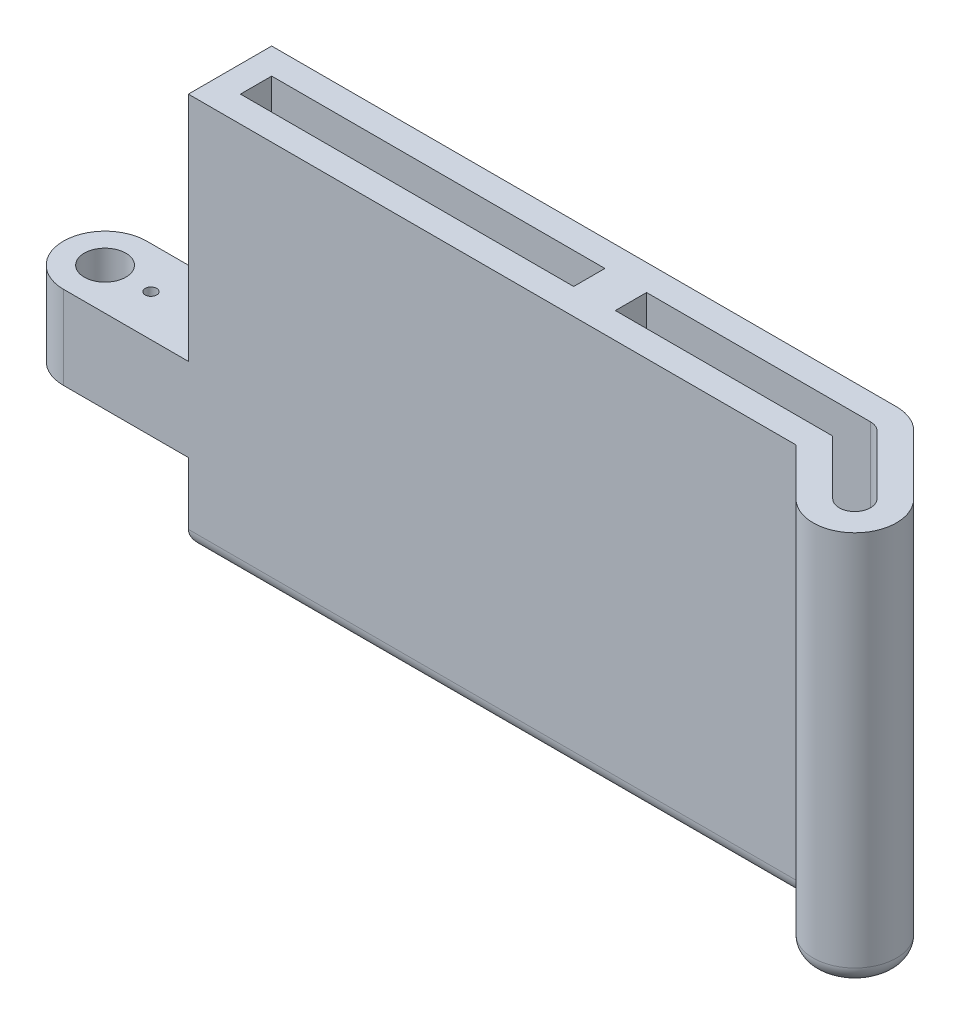
ISO-10303-21;
HEADER;
FILE_DESCRIPTION(('STEP AP214'),'2;1');
FILE_NAME('part.step','',(''),(''),'','','');
FILE_SCHEMA(('AUTOMOTIVE_DESIGN { 1 0 10303 214 1 1 1 1 }'));
ENDSEC;
DATA;
#1=APPLICATION_CONTEXT('core data for automotive mechanical design processes');
#2=APPLICATION_PROTOCOL_DEFINITION('international standard','automotive_design',2000,#1);
#3=PRODUCT_CONTEXT('',#1,'mechanical');
#4=PRODUCT('Part','Part','',(#3));
#5=PRODUCT_RELATED_PRODUCT_CATEGORY('part','',(#4));
#6=PRODUCT_DEFINITION_FORMATION('','',#4);
#7=PRODUCT_DEFINITION_CONTEXT('part definition',#1,'design');
#8=PRODUCT_DEFINITION('design','',#6,#7);
#9=PRODUCT_DEFINITION_SHAPE('','',#8);
#10=(LENGTH_UNIT() NAMED_UNIT(*) SI_UNIT(.MILLI.,.METRE.));
#11=(NAMED_UNIT(*) PLANE_ANGLE_UNIT() SI_UNIT($,.RADIAN.));
#12=(NAMED_UNIT(*) SI_UNIT($,.STERADIAN.) SOLID_ANGLE_UNIT());
#13=UNCERTAINTY_MEASURE_WITH_UNIT(LENGTH_MEASURE(1.E-05),#10,'distance_accuracy_value','');
#14=(GEOMETRIC_REPRESENTATION_CONTEXT(3) GLOBAL_UNCERTAINTY_ASSIGNED_CONTEXT((#13)) GLOBAL_UNIT_ASSIGNED_CONTEXT((#10,
#11,#12)) REPRESENTATION_CONTEXT('',''));
#15=CARTESIAN_POINT('',(0.,0.,0.));
#16=DIRECTION('',(0.,0.,1.));
#17=DIRECTION('',(1.,0.,0.));
#18=AXIS2_PLACEMENT_3D('',#15,#16,#17);
#19=CARTESIAN_POINT('',(61.6401280605348,59.999999888,-61.6401280605346));
#20=DIRECTION('',(0.707106781186549,0.,-0.707106781186546));
#21=DIRECTION('',(-0.707106781186546,0.,-0.707106781186549));
#22=AXIS2_PLACEMENT_3D('',#19,#20,#21);
#23=PLANE('',#22);
#24=DIRECTION('',(0.,-1.,0.));
#25=VECTOR('',#24,1.);
#26=CARTESIAN_POINT('',(127.770384181604,59.999999888,4.49012806053458));
#27=LINE('',#26,#25);
#28=CARTESIAN_POINT('',(127.770384181604,59.999999888,4.49012806053458));
#29=VERTEX_POINT('',#28);
#30=CARTESIAN_POINT('',(127.770384181604,2.54,4.49012806053458));
#31=VERTEX_POINT('',#30);
#32=EDGE_CURVE('E371',#29,#31,#27,.T.);
#33=ORIENTED_EDGE('',*,*,#32,.T.);
#34=DIRECTION('',(0.707106781186546,0.,0.707106781186549));
#35=VECTOR('',#34,1.);
#36=CARTESIAN_POINT('',(118.790128060535,2.54,-4.49012806053457));
#37=LINE('',#36,#35);
#38=CARTESIAN_POINT('',(118.790128060535,2.54,-4.49012806053457));
#39=VERTEX_POINT('',#38);
#40=EDGE_CURVE('E419',#31,#39,#37,.F.);
#41=ORIENTED_EDGE('',*,*,#40,.T.);
#42=DIRECTION('',(0.,-1.,0.));
#43=VECTOR('',#42,1.);
#44=CARTESIAN_POINT('',(118.790128060535,59.999999888,-4.49012806053457));
#45=LINE('',#44,#43);
#46=CARTESIAN_POINT('',(118.790128060535,59.999999888,-4.49012806053457));
#47=VERTEX_POINT('',#46);
#48=EDGE_CURVE('E388',#47,#39,#45,.T.);
#49=ORIENTED_EDGE('',*,*,#48,.F.);
#50=DIRECTION('',(0.707106781186546,0.,0.707106781186549));
#51=VECTOR('',#50,1.);
#52=CARTESIAN_POINT('',(61.6401280605348,59.999999888,-61.6401280605346));
#53=LINE('',#52,#51);
#54=EDGE_CURVE('E357',#47,#29,#53,.T.);
#55=ORIENTED_EDGE('',*,*,#54,.T.);
#56=EDGE_LOOP('',(#33,#41,#49,#55));
#57=FACE_BOUND('',#56,.T.);
#58=ADVANCED_FACE('F42',(#57),#23,.T.);
#59=CARTESIAN_POINT('',(114.3,59.999999888,0.));
#60=DIRECTION('',(0.,-1.,0.));
#61=DIRECTION('',(0.,0.,-1.));
#62=AXIS2_PLACEMENT_3D('',#59,#60,#61);
#63=CYLINDRICAL_SURFACE('',#62,6.35);
#64=ORIENTED_EDGE('',*,*,#48,.T.);
#65=CARTESIAN_POINT('',(114.3,2.54,0.));
#66=DIRECTION('',(0.,1.,0.));
#67=DIRECTION('',(0.,0.,1.));
#68=AXIS2_PLACEMENT_3D('',#65,#66,#67);
#69=CIRCLE('',#68,6.35);
#70=CARTESIAN_POINT('',(114.3,2.54,-6.35));
#71=VERTEX_POINT('',#70);
#72=EDGE_CURVE('E417',#39,#71,#69,.T.);
#73=ORIENTED_EDGE('',*,*,#72,.T.);
#74=DIRECTION('',(0.,-1.,0.));
#75=VECTOR('',#74,1.);
#76=CARTESIAN_POINT('',(114.3,59.999999888,-6.35));
#77=LINE('',#76,#75);
#78=CARTESIAN_POINT('',(114.3,59.999999888,-6.35));
#79=VERTEX_POINT('',#78);
#80=EDGE_CURVE('E386',#79,#71,#77,.T.);
#81=ORIENTED_EDGE('',*,*,#80,.F.);
#82=CARTESIAN_POINT('',(114.3,59.999999888,0.));
#83=DIRECTION('',(0.,1.,0.));
#84=DIRECTION('',(0.,0.,1.));
#85=AXIS2_PLACEMENT_3D('',#82,#83,#84);
#86=CIRCLE('',#85,6.35);
#87=EDGE_CURVE('E360',#47,#79,#86,.T.);
#88=ORIENTED_EDGE('',*,*,#87,.F.);
#89=EDGE_LOOP('',(#64,#73,#81,#88));
#90=FACE_BOUND('',#89,.T.);
#91=ADVANCED_FACE('F488',(#90),#63,.T.);
#92=CARTESIAN_POINT('',(0.,59.999999888,-6.35));
#93=DIRECTION('',(0.,0.,-1.));
#94=DIRECTION('',(-1.,0.,0.));
#95=AXIS2_PLACEMENT_3D('',#92,#93,#94);
#96=PLANE('',#95);
#97=ORIENTED_EDGE('',*,*,#80,.T.);
#98=DIRECTION('',(1.,0.,0.));
#99=VECTOR('',#98,1.);
#100=CARTESIAN_POINT('',(19.05,2.54,-6.35));
#101=LINE('',#100,#99);
#102=CARTESIAN_POINT('',(19.05,2.54,-6.35));
#103=VERTEX_POINT('',#102);
#104=EDGE_CURVE('E66',#71,#103,#101,.F.);
#105=ORIENTED_EDGE('',*,*,#104,.T.);
#106=DIRECTION('',(0.,1.,0.));
#107=VECTOR('',#106,1.);
#108=CARTESIAN_POINT('',(19.05,12.017000096,-6.35));
#109=LINE('',#108,#107);
#110=CARTESIAN_POINT('',(19.05,12.017000096,-6.35));
#111=VERTEX_POINT('',#110);
#112=EDGE_CURVE('E323',#103,#111,#109,.T.);
#113=ORIENTED_EDGE('',*,*,#112,.T.);
#114=DIRECTION('',(-1.,0.,0.));
#115=VECTOR('',#114,1.);
#116=CARTESIAN_POINT('',(-6.35,12.017000096,-6.35));
#117=LINE('',#116,#115);
#118=CARTESIAN_POINT('',(0.,12.017000096,-6.35));
#119=VERTEX_POINT('',#118);
#120=EDGE_CURVE('E325',#111,#119,#117,.T.);
#121=ORIENTED_EDGE('',*,*,#120,.T.);
#122=DIRECTION('',(0.,-1.,0.));
#123=VECTOR('',#122,1.);
#124=CARTESIAN_POINT('',(0.,59.999999888,-6.35));
#125=LINE('',#124,#123);
#126=CARTESIAN_POINT('',(0.,24.717000096,-6.35));
#127=VERTEX_POINT('',#126);
#128=EDGE_CURVE('E383',#127,#119,#125,.T.);
#129=ORIENTED_EDGE('',*,*,#128,.F.);
#130=DIRECTION('',(1.,0.,0.));
#131=VECTOR('',#130,1.);
#132=CARTESIAN_POINT('',(-6.34999999999999,24.717000096,-6.35));
#133=LINE('',#132,#131);
#134=CARTESIAN_POINT('',(19.05,24.717000096,-6.35));
#135=VERTEX_POINT('',#134);
#136=EDGE_CURVE('E348',#127,#135,#133,.T.);
#137=ORIENTED_EDGE('',*,*,#136,.T.);
#138=DIRECTION('',(0.,1.,0.));
#139=VECTOR('',#138,1.);
#140=CARTESIAN_POINT('',(19.05,59.999999888,-6.35));
#141=LINE('',#140,#139);
#142=CARTESIAN_POINT('',(19.05,59.999999888,-6.35));
#143=VERTEX_POINT('',#142);
#144=EDGE_CURVE('E341',#135,#143,#141,.T.);
#145=ORIENTED_EDGE('',*,*,#144,.T.);
#146=DIRECTION('',(1.,0.,0.));
#147=VECTOR('',#146,1.);
#148=CARTESIAN_POINT('',(0.,59.999999888,-6.35));
#149=LINE('',#148,#147);
#150=EDGE_CURVE('E363',#143,#79,#149,.T.);
#151=ORIENTED_EDGE('',*,*,#150,.T.);
#152=EDGE_LOOP('',(#97,#105,#113,#121,#129,#137,#145,#151));
#153=FACE_BOUND('',#152,.T.);
#154=ADVANCED_FACE('F484',(#153),#96,.T.);
#155=CARTESIAN_POINT('',(0.,59.999999888,0.));
#156=DIRECTION('',(0.,-1.,0.));
#157=DIRECTION('',(0.,0.,-1.));
#158=AXIS2_PLACEMENT_3D('',#155,#156,#157);
#159=CYLINDRICAL_SURFACE('',#158,6.35);
#160=ORIENTED_EDGE('',*,*,#128,.T.);
#161=CARTESIAN_POINT('',(0.,12.017000096,0.));
#162=DIRECTION('',(0.,1.,0.));
#163=DIRECTION('',(0.,0.,1.));
#164=AXIS2_PLACEMENT_3D('',#161,#162,#163);
#165=CIRCLE('',#164,6.35);
#166=CARTESIAN_POINT('',(0.,12.017000096,6.35));
#167=VERTEX_POINT('',#166);
#168=EDGE_CURVE('E355',#119,#167,#165,.T.);
#169=ORIENTED_EDGE('',*,*,#168,.T.);
#170=DIRECTION('',(0.,-1.,0.));
#171=VECTOR('',#170,1.);
#172=CARTESIAN_POINT('',(0.,59.999999888,6.35));
#173=LINE('',#172,#171);
#174=CARTESIAN_POINT('',(0.,24.717000096,6.35));
#175=VERTEX_POINT('',#174);
#176=EDGE_CURVE('E380',#175,#167,#173,.T.);
#177=ORIENTED_EDGE('',*,*,#176,.F.);
#178=CARTESIAN_POINT('',(0.,24.717000096,0.));
#179=DIRECTION('',(0.,-1.,0.));
#180=DIRECTION('',(1.,0.,0.));
#181=AXIS2_PLACEMENT_3D('',#178,#179,#180);
#182=CIRCLE('',#181,6.35);
#183=EDGE_CURVE('E337',#175,#127,#182,.T.);
#184=ORIENTED_EDGE('',*,*,#183,.T.);
#185=EDGE_LOOP('',(#160,#169,#177,#184));
#186=FACE_BOUND('',#185,.T.);
#187=ADVANCED_FACE('F478',(#186),#159,.T.);
#188=CARTESIAN_POINT('',(0.,59.999999888,6.35));
#189=DIRECTION('',(0.,0.,-1.));
#190=DIRECTION('',(-1.,0.,0.));
#191=AXIS2_PLACEMENT_3D('',#188,#189,#190);
#192=PLANE('',#191);
#193=DIRECTION('',(0.,1.,0.));
#194=VECTOR('',#193,1.);
#195=CARTESIAN_POINT('',(19.05,12.017000096,6.35));
#196=LINE('',#195,#194);
#197=CARTESIAN_POINT('',(19.05,2.54,6.35));
#198=VERTEX_POINT('',#197);
#199=CARTESIAN_POINT('',(19.05,12.017000096,6.35));
#200=VERTEX_POINT('',#199);
#201=EDGE_CURVE('E330',#198,#200,#196,.T.);
#202=ORIENTED_EDGE('',*,*,#201,.F.);
#203=DIRECTION('',(1.,0.,0.));
#204=VECTOR('',#203,1.);
#205=CARTESIAN_POINT('',(0.,2.54,6.35));
#206=LINE('',#205,#204);
#207=CARTESIAN_POINT('',(111.669743878931,2.54,6.35));
#208=VERTEX_POINT('',#207);
#209=EDGE_CURVE('E12',#198,#208,#206,.T.);
#210=ORIENTED_EDGE('',*,*,#209,.T.);
#211=DIRECTION('',(0.,-1.,0.));
#212=VECTOR('',#211,1.);
#213=CARTESIAN_POINT('',(111.669743878931,59.999999888,6.35));
#214=LINE('',#213,#212);
#215=CARTESIAN_POINT('',(111.669743878931,59.999999888,6.35));
#216=VERTEX_POINT('',#215);
#217=EDGE_CURVE('E377',#216,#208,#214,.T.);
#218=ORIENTED_EDGE('',*,*,#217,.F.);
#219=DIRECTION('',(1.,0.,0.));
#220=VECTOR('',#219,1.);
#221=CARTESIAN_POINT('',(0.,59.999999888,6.35));
#222=LINE('',#221,#220);
#223=CARTESIAN_POINT('',(19.05,59.999999888,6.35));
#224=VERTEX_POINT('',#223);
#225=EDGE_CURVE('E365',#224,#216,#222,.T.);
#226=ORIENTED_EDGE('',*,*,#225,.F.);
#227=DIRECTION('',(0.,1.,0.));
#228=VECTOR('',#227,1.);
#229=CARTESIAN_POINT('',(19.05,59.999999888,6.35));
#230=LINE('',#229,#228);
#231=CARTESIAN_POINT('',(19.05,24.717000096,6.35));
#232=VERTEX_POINT('',#231);
#233=EDGE_CURVE('E346',#232,#224,#230,.T.);
#234=ORIENTED_EDGE('',*,*,#233,.F.);
#235=DIRECTION('',(1.,0.,0.));
#236=VECTOR('',#235,1.);
#237=CARTESIAN_POINT('',(-6.34999999999999,24.717000096,6.35));
#238=LINE('',#237,#236);
#239=EDGE_CURVE('E332',#175,#232,#238,.T.);
#240=ORIENTED_EDGE('',*,*,#239,.F.);
#241=ORIENTED_EDGE('',*,*,#176,.T.);
#242=DIRECTION('',(-1.,0.,0.));
#243=VECTOR('',#242,1.);
#244=CARTESIAN_POINT('',(-6.35,12.017000096,6.35));
#245=LINE('',#244,#243);
#246=EDGE_CURVE('E326',#200,#167,#245,.T.);
#247=ORIENTED_EDGE('',*,*,#246,.F.);
#248=EDGE_LOOP('',(#202,#210,#218,#226,#234,#240,#241,#247));
#249=FACE_BOUND('',#248,.T.);
#250=ADVANCED_FACE('F454',(#249),#192,.F.);
#251=CARTESIAN_POINT('',(52.6598719394656,59.999999888,-52.6598719394654));
#252=DIRECTION('',(0.707106781186549,0.,-0.707106781186546));
#253=DIRECTION('',(-0.707106781186546,0.,-0.707106781186549));
#254=AXIS2_PLACEMENT_3D('',#251,#252,#253);
#255=PLANE('',#254);
#256=ORIENTED_EDGE('',*,*,#217,.T.);
#257=DIRECTION('',(0.707106781186546,0.,0.707106781186549));
#258=VECTOR('',#257,1.);
#259=CARTESIAN_POINT('',(52.6598719394656,2.54,-52.6598719394654));
#260=LINE('',#259,#258);
#261=CARTESIAN_POINT('',(118.790128060535,2.54,13.4703841816037));
#262=VERTEX_POINT('',#261);
#263=EDGE_CURVE('E415',#208,#262,#260,.T.);
#264=ORIENTED_EDGE('',*,*,#263,.T.);
#265=DIRECTION('',(0.,-1.,0.));
#266=VECTOR('',#265,1.);
#267=CARTESIAN_POINT('',(118.790128060535,59.999999888,13.4703841816037));
#268=LINE('',#267,#266);
#269=CARTESIAN_POINT('',(118.790128060535,59.999999888,13.4703841816037));
#270=VERTEX_POINT('',#269);
#271=EDGE_CURVE('E374',#270,#262,#268,.T.);
#272=ORIENTED_EDGE('',*,*,#271,.F.);
#273=DIRECTION('',(0.707106781186546,0.,0.707106781186549));
#274=VECTOR('',#273,1.);
#275=CARTESIAN_POINT('',(52.6598719394656,59.999999888,-52.6598719394654));
#276=LINE('',#275,#274);
#277=EDGE_CURVE('E367',#216,#270,#276,.T.);
#278=ORIENTED_EDGE('',*,*,#277,.F.);
#279=EDGE_LOOP('',(#256,#264,#272,#278));
#280=FACE_BOUND('',#279,.T.);
#281=ADVANCED_FACE('F459',(#280),#255,.F.);
#282=CARTESIAN_POINT('',(123.280256121069,59.999999888,8.98025612106917));
#283=DIRECTION('',(0.,-1.,0.));
#284=DIRECTION('',(0.,0.,-1.));
#285=AXIS2_PLACEMENT_3D('',#282,#283,#284);
#286=CYLINDRICAL_SURFACE('',#285,6.35);
#287=ORIENTED_EDGE('',*,*,#271,.T.);
#288=CARTESIAN_POINT('',(123.280256121069,2.54,8.98025612106917));
#289=DIRECTION('',(0.,1.,0.));
#290=DIRECTION('',(0.,0.,1.));
#291=AXIS2_PLACEMENT_3D('',#288,#289,#290);
#292=CIRCLE('',#291,6.35);
#293=EDGE_CURVE('E391',#262,#31,#292,.T.);
#294=ORIENTED_EDGE('',*,*,#293,.T.);
#295=ORIENTED_EDGE('',*,*,#32,.F.);
#296=CARTESIAN_POINT('',(123.280256121069,59.999999888,8.98025612106917));
#297=DIRECTION('',(0.,1.,0.));
#298=DIRECTION('',(0.,0.,1.));
#299=AXIS2_PLACEMENT_3D('',#296,#297,#298);
#300=CIRCLE('',#299,6.35);
#301=EDGE_CURVE('E369',#270,#29,#300,.T.);
#302=ORIENTED_EDGE('',*,*,#301,.F.);
#303=EDGE_LOOP('',(#287,#294,#295,#302));
#304=FACE_BOUND('',#303,.T.);
#305=ADVANCED_FACE('F600',(#304),#286,.T.);
#306=CARTESIAN_POINT('',(0.,59.999999888,0.));
#307=DIRECTION('',(0.,1.,0.));
#308=DIRECTION('',(0.,0.,1.));
#309=AXIS2_PLACEMENT_3D('',#306,#307,#308);
#310=PLANE('',#309);
#311=CARTESIAN_POINT('',(114.3,59.999999888,0.));
#312=DIRECTION('',(0.,1.,0.));
#313=DIRECTION('',(0.,0.,1.));
#314=AXIS2_PLACEMENT_3D('',#311,#312,#313);
#315=CIRCLE('',#314,2.38125000000001);
#316=CARTESIAN_POINT('',(115.9837980227,59.999999888,-1.68379802270046));
#317=VERTEX_POINT('',#316);
#318=CARTESIAN_POINT('',(114.3,59.999999888,-2.38125));
#319=VERTEX_POINT('',#318);
#320=EDGE_CURVE('E220',#317,#319,#315,.T.);
#321=ORIENTED_EDGE('',*,*,#320,.F.);
#322=DIRECTION('',(-0.707106781186545,0.,-0.70710678118655));
#323=VECTOR('',#322,1.);
#324=CARTESIAN_POINT('',(124.96405414377,59.999999888,7.2964580983687));
#325=LINE('',#324,#323);
#326=CARTESIAN_POINT('',(124.96405414377,59.999999888,7.2964580983687));
#327=VERTEX_POINT('',#326);
#328=EDGE_CURVE('E239',#327,#317,#325,.T.);
#329=ORIENTED_EDGE('',*,*,#328,.F.);
#330=CARTESIAN_POINT('',(123.280256121069,59.999999888,8.98025612106917));
#331=DIRECTION('',(0.,1.,0.));
#332=DIRECTION('',(0.,0.,1.));
#333=AXIS2_PLACEMENT_3D('',#330,#331,#332);
#334=CIRCLE('',#333,2.38124999999998);
#335=CARTESIAN_POINT('',(121.596458098369,59.999999888,10.6640541437696));
#336=VERTEX_POINT('',#335);
#337=EDGE_CURVE('E242',#336,#327,#334,.T.);
#338=ORIENTED_EDGE('',*,*,#337,.F.);
#339=DIRECTION('',(0.707106781186547,0.,0.707106781186548));
#340=VECTOR('',#339,1.);
#341=CARTESIAN_POINT('',(113.313653954599,59.999999888,2.38125));
#342=LINE('',#341,#340);
#343=CARTESIAN_POINT('',(113.313653954599,59.999999888,2.38125));
#344=VERTEX_POINT('',#343);
#345=EDGE_CURVE('E265',#344,#336,#342,.T.);
#346=ORIENTED_EDGE('',*,*,#345,.F.);
#347=DIRECTION('',(1.,0.,0.));
#348=VECTOR('',#347,1.);
#349=CARTESIAN_POINT('',(80.16875,59.999999888,2.38125));
#350=LINE('',#349,#348);
#351=CARTESIAN_POINT('',(80.16875,59.999999888,2.38125));
#352=VERTEX_POINT('',#351);
#353=EDGE_CURVE('E262',#352,#344,#350,.T.);
#354=ORIENTED_EDGE('',*,*,#353,.F.);
#355=DIRECTION('',(0.,0.,1.));
#356=VECTOR('',#355,1.);
#357=CARTESIAN_POINT('',(80.16875,59.999999888,-2.38125));
#358=LINE('',#357,#356);
#359=CARTESIAN_POINT('',(80.16875,59.999999888,-2.38125));
#360=VERTEX_POINT('',#359);
#361=EDGE_CURVE('E259',#360,#352,#358,.T.);
#362=ORIENTED_EDGE('',*,*,#361,.F.);
#363=DIRECTION('',(-1.,0.,0.));
#364=VECTOR('',#363,1.);
#365=CARTESIAN_POINT('',(114.3,59.999999888,-2.38125));
#366=LINE('',#365,#364);
#367=EDGE_CURVE('E256',#319,#360,#366,.T.);
#368=ORIENTED_EDGE('',*,*,#367,.F.);
#369=EDGE_LOOP('',(#321,#329,#338,#346,#354,#362,#368));
#370=FACE_BOUND('',#369,.T.);
#371=DIRECTION('',(-1.,0.,0.));
#372=VECTOR('',#371,1.);
#373=CARTESIAN_POINT('',(73.81875,59.999999888,-2.38125));
#374=LINE('',#373,#372);
#375=CARTESIAN_POINT('',(73.81875,59.999999888,-2.38125));
#376=VERTEX_POINT('',#375);
#377=CARTESIAN_POINT('',(23.01875,59.999999888,-2.38125));
#378=VERTEX_POINT('',#377);
#379=EDGE_CURVE('E257',#376,#378,#374,.T.);
#380=ORIENTED_EDGE('',*,*,#379,.F.);
#381=DIRECTION('',(0.,0.,-1.));
#382=VECTOR('',#381,1.);
#383=CARTESIAN_POINT('',(73.81875,59.999999888,-2.38125));
#384=LINE('',#383,#382);
#385=CARTESIAN_POINT('',(73.81875,59.999999888,2.38125));
#386=VERTEX_POINT('',#385);
#387=EDGE_CURVE('E292',#386,#376,#384,.T.);
#388=ORIENTED_EDGE('',*,*,#387,.F.);
#389=DIRECTION('',(1.,0.,0.));
#390=VECTOR('',#389,1.);
#391=CARTESIAN_POINT('',(23.01875,59.999999888,2.38125));
#392=LINE('',#391,#390);
#393=CARTESIAN_POINT('',(23.01875,59.999999888,2.38125));
#394=VERTEX_POINT('',#393);
#395=EDGE_CURVE('E295',#394,#386,#392,.T.);
#396=ORIENTED_EDGE('',*,*,#395,.F.);
#397=DIRECTION('',(0.,0.,1.));
#398=VECTOR('',#397,1.);
#399=CARTESIAN_POINT('',(23.01875,59.999999888,-2.38125));
#400=LINE('',#399,#398);
#401=EDGE_CURVE('E299',#378,#394,#400,.T.);
#402=ORIENTED_EDGE('',*,*,#401,.F.);
#403=EDGE_LOOP('',(#380,#388,#396,#402));
#404=FACE_BOUND('',#403,.T.);
#405=DIRECTION('',(0.,0.,1.));
#406=VECTOR('',#405,1.);
#407=CARTESIAN_POINT('',(19.05,59.999999888,-6.35));
#408=LINE('',#407,#406);
#409=EDGE_CURVE('E342',#143,#224,#408,.T.);
#410=ORIENTED_EDGE('',*,*,#409,.T.);
#411=ORIENTED_EDGE('',*,*,#225,.T.);
#412=ORIENTED_EDGE('',*,*,#277,.T.);
#413=ORIENTED_EDGE('',*,*,#301,.T.);
#414=ORIENTED_EDGE('',*,*,#54,.F.);
#415=ORIENTED_EDGE('',*,*,#87,.T.);
#416=ORIENTED_EDGE('',*,*,#150,.F.);
#417=EDGE_LOOP('',(#410,#411,#412,#413,#414,#415,#416));
#418=FACE_BOUND('',#417,.T.);
#419=ADVANCED_FACE('F463',(#370,#404,#418),#310,.T.);
#420=CARTESIAN_POINT('',(0.,0.,0.));
#421=DIRECTION('',(0.,1.,0.));
#422=DIRECTION('',(0.,0.,1.));
#423=AXIS2_PLACEMENT_3D('',#420,#421,#422);
#424=PLANE('',#423);
#425=CARTESIAN_POINT('',(114.3,0.,0.));
#426=DIRECTION('',(0.,1.,0.));
#427=DIRECTION('',(0.,0.,1.));
#428=AXIS2_PLACEMENT_3D('',#425,#426,#427);
#429=CIRCLE('',#428,3.81);
#430=CARTESIAN_POINT('',(114.3,0.,-3.81));
#431=VERTEX_POINT('',#430);
#432=CARTESIAN_POINT('',(116.994076836321,0.,-2.69407683632074));
#433=VERTEX_POINT('',#432);
#434=EDGE_CURVE('E406',#431,#433,#429,.F.);
#435=ORIENTED_EDGE('',*,*,#434,.T.);
#436=DIRECTION('',(0.707106781186546,0.,0.707106781186549));
#437=VECTOR('',#436,1.);
#438=CARTESIAN_POINT('',(125.97433295739,0.,6.28617928474841));
#439=LINE('',#438,#437);
#440=CARTESIAN_POINT('',(125.97433295739,0.,6.28617928474842));
#441=VERTEX_POINT('',#440);
#442=EDGE_CURVE('E413',#433,#441,#439,.T.);
#443=ORIENTED_EDGE('',*,*,#442,.T.);
#444=CARTESIAN_POINT('',(123.280256121069,0.,8.98025612106917));
#445=DIRECTION('',(0.,1.,0.));
#446=DIRECTION('',(0.,0.,1.));
#447=AXIS2_PLACEMENT_3D('',#444,#445,#446);
#448=CIRCLE('',#447,3.81);
#449=CARTESIAN_POINT('',(120.586179284748,0.,11.6743329573899));
#450=VERTEX_POINT('',#449);
#451=EDGE_CURVE('E410',#441,#450,#448,.F.);
#452=ORIENTED_EDGE('',*,*,#451,.T.);
#453=DIRECTION('',(0.707106781186546,0.,0.707106781186549));
#454=VECTOR('',#453,1.);
#455=CARTESIAN_POINT('',(54.4559231636795,0.,-54.4559231636793));
#456=LINE('',#455,#454);
#457=CARTESIAN_POINT('',(112.721846327359,0.,3.81));
#458=VERTEX_POINT('',#457);
#459=EDGE_CURVE('E408',#450,#458,#456,.F.);
#460=ORIENTED_EDGE('',*,*,#459,.T.);
#461=DIRECTION('',(1.,0.,0.));
#462=VECTOR('',#461,1.);
#463=CARTESIAN_POINT('',(0.,0.,3.81));
#464=LINE('',#463,#462);
#465=CARTESIAN_POINT('',(21.59,0.,3.81));
#466=VERTEX_POINT('',#465);
#467=EDGE_CURVE('E400',#458,#466,#464,.F.);
#468=ORIENTED_EDGE('',*,*,#467,.T.);
#469=DIRECTION('',(0.,0.,1.));
#470=VECTOR('',#469,1.);
#471=CARTESIAN_POINT('',(21.59,0.,0.));
#472=LINE('',#471,#470);
#473=CARTESIAN_POINT('',(21.59,0.,-3.81));
#474=VERTEX_POINT('',#473);
#475=EDGE_CURVE('E402',#466,#474,#472,.F.);
#476=ORIENTED_EDGE('',*,*,#475,.T.);
#477=DIRECTION('',(1.,0.,0.));
#478=VECTOR('',#477,1.);
#479=CARTESIAN_POINT('',(114.3,0.,-3.81));
#480=LINE('',#479,#478);
#481=EDGE_CURVE('E404',#474,#431,#480,.T.);
#482=ORIENTED_EDGE('',*,*,#481,.T.);
#483=EDGE_LOOP('',(#435,#443,#452,#460,#468,#476,#482));
#484=FACE_BOUND('',#483,.T.);
#485=DIRECTION('',(-0.707106781186545,0.,-0.70710678118655));
#486=VECTOR('',#485,1.);
#487=CARTESIAN_POINT('',(124.96405414377,0.,7.2964580983687));
#488=LINE('',#487,#486);
#489=CARTESIAN_POINT('',(124.96405414377,0.,7.2964580983687));
#490=VERTEX_POINT('',#489);
#491=CARTESIAN_POINT('',(115.9837980227,0.,-1.68379802270046));
#492=VERTEX_POINT('',#491);
#493=EDGE_CURVE('E225',#490,#492,#488,.T.);
#494=ORIENTED_EDGE('',*,*,#493,.T.);
#495=CARTESIAN_POINT('',(114.3,0.,0.));
#496=DIRECTION('',(0.,1.,0.));
#497=DIRECTION('',(0.,0.,1.));
#498=AXIS2_PLACEMENT_3D('',#495,#496,#497);
#499=CIRCLE('',#498,2.38125000000001);
#500=CARTESIAN_POINT('',(114.3,0.,-2.38125));
#501=VERTEX_POINT('',#500);
#502=EDGE_CURVE('E217',#492,#501,#499,.T.);
#503=ORIENTED_EDGE('',*,*,#502,.T.);
#504=DIRECTION('',(-1.,0.,0.));
#505=VECTOR('',#504,1.);
#506=CARTESIAN_POINT('',(114.3,0.,-2.38125));
#507=LINE('',#506,#505);
#508=CARTESIAN_POINT('',(80.16875,0.,-2.38125));
#509=VERTEX_POINT('',#508);
#510=EDGE_CURVE('E229',#501,#509,#507,.T.);
#511=ORIENTED_EDGE('',*,*,#510,.T.);
#512=DIRECTION('',(0.,0.,1.));
#513=VECTOR('',#512,1.);
#514=CARTESIAN_POINT('',(80.16875,0.,-2.38125));
#515=LINE('',#514,#513);
#516=CARTESIAN_POINT('',(80.16875,0.,2.38125));
#517=VERTEX_POINT('',#516);
#518=EDGE_CURVE('E233',#509,#517,#515,.T.);
#519=ORIENTED_EDGE('',*,*,#518,.T.);
#520=DIRECTION('',(1.,0.,0.));
#521=VECTOR('',#520,1.);
#522=CARTESIAN_POINT('',(80.16875,0.,2.38125));
#523=LINE('',#522,#521);
#524=CARTESIAN_POINT('',(113.313653954599,0.,2.38125));
#525=VERTEX_POINT('',#524);
#526=EDGE_CURVE('E246',#517,#525,#523,.T.);
#527=ORIENTED_EDGE('',*,*,#526,.T.);
#528=DIRECTION('',(0.707106781186547,0.,0.707106781186548));
#529=VECTOR('',#528,1.);
#530=CARTESIAN_POINT('',(113.313653954599,0.,2.38125));
#531=LINE('',#530,#529);
#532=CARTESIAN_POINT('',(121.596458098369,0.,10.6640541437696));
#533=VERTEX_POINT('',#532);
#534=EDGE_CURVE('E249',#525,#533,#531,.T.);
#535=ORIENTED_EDGE('',*,*,#534,.T.);
#536=CARTESIAN_POINT('',(123.280256121069,0.,8.98025612106917));
#537=DIRECTION('',(0.,1.,0.));
#538=DIRECTION('',(0.,0.,1.));
#539=AXIS2_PLACEMENT_3D('',#536,#537,#538);
#540=CIRCLE('',#539,2.38124999999998);
#541=EDGE_CURVE('E252',#533,#490,#540,.T.);
#542=ORIENTED_EDGE('',*,*,#541,.T.);
#543=EDGE_LOOP('',(#494,#503,#511,#519,#527,#535,#542));
#544=FACE_BOUND('',#543,.T.);
#545=DIRECTION('',(0.,0.,-1.));
#546=VECTOR('',#545,1.);
#547=CARTESIAN_POINT('',(73.81875,0.,-2.38125));
#548=LINE('',#547,#546);
#549=CARTESIAN_POINT('',(73.81875,0.,2.38125));
#550=VERTEX_POINT('',#549);
#551=CARTESIAN_POINT('',(73.81875,0.,-2.38125));
#552=VERTEX_POINT('',#551);
#553=EDGE_CURVE('E285',#550,#552,#548,.T.);
#554=ORIENTED_EDGE('',*,*,#553,.T.);
#555=DIRECTION('',(-1.,0.,0.));
#556=VECTOR('',#555,1.);
#557=CARTESIAN_POINT('',(73.81875,0.,-2.38125));
#558=LINE('',#557,#556);
#559=CARTESIAN_POINT('',(23.01875,0.,-2.38125));
#560=VERTEX_POINT('',#559);
#561=EDGE_CURVE('E296',#552,#560,#558,.T.);
#562=ORIENTED_EDGE('',*,*,#561,.T.);
#563=DIRECTION('',(0.,0.,1.));
#564=VECTOR('',#563,1.);
#565=CARTESIAN_POINT('',(23.01875,0.,-2.38125));
#566=LINE('',#565,#564);
#567=CARTESIAN_POINT('',(23.01875,0.,2.38125));
#568=VERTEX_POINT('',#567);
#569=EDGE_CURVE('E308',#560,#568,#566,.T.);
#570=ORIENTED_EDGE('',*,*,#569,.T.);
#571=DIRECTION('',(1.,0.,0.));
#572=VECTOR('',#571,1.);
#573=CARTESIAN_POINT('',(23.01875,0.,2.38125));
#574=LINE('',#573,#572);
#575=EDGE_CURVE('E305',#568,#550,#574,.T.);
#576=ORIENTED_EDGE('',*,*,#575,.T.);
#577=EDGE_LOOP('',(#554,#562,#570,#576));
#578=FACE_BOUND('',#577,.T.);
#579=ADVANCED_FACE('F235',(#484,#544,#578),#424,.F.);
#580=CARTESIAN_POINT('',(-6.35,12.017000096,-6.35));
#581=DIRECTION('',(0.,1.,0.));
#582=DIRECTION('',(0.,0.,1.));
#583=AXIS2_PLACEMENT_3D('',#580,#581,#582);
#584=PLANE('',#583);
#585=CARTESIAN_POINT('',(0.,12.017000096,0.));
#586=DIRECTION('',(0.,-1.,0.));
#587=DIRECTION('',(0.,0.,-1.));
#588=AXIS2_PLACEMENT_3D('',#585,#586,#587);
#589=CIRCLE('',#588,3.175);
#590=CARTESIAN_POINT('',(0.,12.017000096,-3.175));
#591=VERTEX_POINT('',#590);
#592=EDGE_CURVE('E272',#591,#591,#589,.T.);
#593=ORIENTED_EDGE('',*,*,#592,.F.);
#594=EDGE_LOOP('',(#593));
#595=FACE_BOUND('',#594,.T.);
#596=CARTESIAN_POINT('',(6.99999997,12.017000096,0.));
#597=DIRECTION('',(0.,-1.,0.));
#598=DIRECTION('',(0.,0.,-1.));
#599=AXIS2_PLACEMENT_3D('',#596,#597,#598);
#600=CIRCLE('',#599,0.877000024);
#601=CARTESIAN_POINT('',(6.99999997,12.017000096,-0.877000024));
#602=VERTEX_POINT('',#601);
#603=EDGE_CURVE('E316',#602,#602,#600,.T.);
#604=ORIENTED_EDGE('',*,*,#603,.F.);
#605=EDGE_LOOP('',(#604));
#606=FACE_BOUND('',#605,.T.);
#607=CARTESIAN_POINT('',(16.000000004,12.017000096,0.));
#608=DIRECTION('',(0.,-1.,0.));
#609=DIRECTION('',(0.,0.,-1.));
#610=AXIS2_PLACEMENT_3D('',#607,#608,#609);
#611=CIRCLE('',#610,0.877000023999999);
#612=CARTESIAN_POINT('',(16.000000004,12.017000096,-0.877000023999999));
#613=VERTEX_POINT('',#612);
#614=EDGE_CURVE('E320',#613,#613,#611,.T.);
#615=ORIENTED_EDGE('',*,*,#614,.F.);
#616=EDGE_LOOP('',(#615));
#617=FACE_BOUND('',#616,.T.);
#618=ORIENTED_EDGE('',*,*,#120,.F.);
#619=DIRECTION('',(0.,0.,1.));
#620=VECTOR('',#619,1.);
#621=CARTESIAN_POINT('',(19.05,12.017000096,-6.35));
#622=LINE('',#621,#620);
#623=EDGE_CURVE('E329',#111,#200,#622,.T.);
#624=ORIENTED_EDGE('',*,*,#623,.T.);
#625=ORIENTED_EDGE('',*,*,#246,.T.);
#626=ORIENTED_EDGE('',*,*,#168,.F.);
#627=EDGE_LOOP('',(#618,#624,#625,#626));
#628=FACE_BOUND('',#627,.T.);
#629=ADVANCED_FACE('F481',(#595,#606,#617,#628),#584,.F.);
#630=CARTESIAN_POINT('',(19.05,12.017000096,-6.35));
#631=DIRECTION('',(1.,0.,0.));
#632=DIRECTION('',(0.,1.,0.));
#633=AXIS2_PLACEMENT_3D('',#630,#631,#632);
#634=PLANE('',#633);
#635=ORIENTED_EDGE('',*,*,#112,.F.);
#636=DIRECTION('',(0.,0.,1.));
#637=VECTOR('',#636,1.);
#638=CARTESIAN_POINT('',(19.05,2.54,-6.35));
#639=LINE('',#638,#637);
#640=EDGE_CURVE('E51',#103,#198,#639,.T.);
#641=ORIENTED_EDGE('',*,*,#640,.T.);
#642=ORIENTED_EDGE('',*,*,#201,.T.);
#643=ORIENTED_EDGE('',*,*,#623,.F.);
#644=EDGE_LOOP('',(#635,#641,#642,#643));
#645=FACE_BOUND('',#644,.T.);
#646=ADVANCED_FACE('F483',(#645),#634,.F.);
#647=CARTESIAN_POINT('',(-6.34999999999999,24.717000096,-6.35));
#648=DIRECTION('',(0.,-1.,0.));
#649=DIRECTION('',(1.,0.,0.));
#650=AXIS2_PLACEMENT_3D('',#647,#648,#649);
#651=PLANE('',#650);
#652=CARTESIAN_POINT('',(0.,24.717000096,0.));
#653=DIRECTION('',(0.,-1.,0.));
#654=DIRECTION('',(1.,0.,0.));
#655=AXIS2_PLACEMENT_3D('',#652,#653,#654);
#656=CIRCLE('',#655,3.175);
#657=CARTESIAN_POINT('',(3.175,24.717000096,0.));
#658=VERTEX_POINT('',#657);
#659=EDGE_CURVE('E315',#658,#658,#656,.T.);
#660=ORIENTED_EDGE('',*,*,#659,.T.);
#661=EDGE_LOOP('',(#660));
#662=FACE_BOUND('',#661,.T.);
#663=CARTESIAN_POINT('',(6.99999997,24.717000096,0.));
#664=DIRECTION('',(0.,-1.,0.));
#665=DIRECTION('',(1.,0.,0.));
#666=AXIS2_PLACEMENT_3D('',#663,#664,#665);
#667=CIRCLE('',#666,0.877000024);
#668=CARTESIAN_POINT('',(7.876999994,24.717000096,0.));
#669=VERTEX_POINT('',#668);
#670=EDGE_CURVE('E345',#669,#669,#667,.T.);
#671=ORIENTED_EDGE('',*,*,#670,.T.);
#672=EDGE_LOOP('',(#671));
#673=FACE_BOUND('',#672,.T.);
#674=CARTESIAN_POINT('',(16.000000004,24.717000096,0.));
#675=DIRECTION('',(0.,-1.,0.));
#676=DIRECTION('',(1.,0.,0.));
#677=AXIS2_PLACEMENT_3D('',#674,#675,#676);
#678=CIRCLE('',#677,0.877000023999999);
#679=CARTESIAN_POINT('',(16.877000028,24.717000096,0.));
#680=VERTEX_POINT('',#679);
#681=EDGE_CURVE('E319',#680,#680,#678,.T.);
#682=ORIENTED_EDGE('',*,*,#681,.T.);
#683=EDGE_LOOP('',(#682));
#684=FACE_BOUND('',#683,.T.);
#685=ORIENTED_EDGE('',*,*,#239,.T.);
#686=DIRECTION('',(0.,0.,1.));
#687=VECTOR('',#686,1.);
#688=CARTESIAN_POINT('',(19.05,24.717000096,-6.35));
#689=LINE('',#688,#687);
#690=EDGE_CURVE('E338',#135,#232,#689,.T.);
#691=ORIENTED_EDGE('',*,*,#690,.F.);
#692=ORIENTED_EDGE('',*,*,#136,.F.);
#693=ORIENTED_EDGE('',*,*,#183,.F.);
#694=EDGE_LOOP('',(#685,#691,#692,#693));
#695=FACE_BOUND('',#694,.T.);
#696=ADVANCED_FACE('F475',(#662,#673,#684,#695),#651,.F.);
#697=CARTESIAN_POINT('',(19.05,59.999999888,-6.35));
#698=DIRECTION('',(1.,0.,0.));
#699=DIRECTION('',(0.,0.,-1.));
#700=AXIS2_PLACEMENT_3D('',#697,#698,#699);
#701=PLANE('',#700);
#702=ORIENTED_EDGE('',*,*,#233,.T.);
#703=ORIENTED_EDGE('',*,*,#409,.F.);
#704=ORIENTED_EDGE('',*,*,#144,.F.);
#705=ORIENTED_EDGE('',*,*,#690,.T.);
#706=EDGE_LOOP('',(#702,#703,#704,#705));
#707=FACE_BOUND('',#706,.T.);
#708=ADVANCED_FACE('F471',(#707),#701,.F.);
#709=CARTESIAN_POINT('',(16.000000004,59.999999888,0.));
#710=DIRECTION('',(0.,-1.,0.));
#711=DIRECTION('',(0.,0.,-1.));
#712=AXIS2_PLACEMENT_3D('',#709,#710,#711);
#713=CYLINDRICAL_SURFACE('',#712,0.877000023999999);
#714=ORIENTED_EDGE('',*,*,#614,.T.);
#715=EDGE_LOOP('',(#714));
#716=FACE_BOUND('',#715,.T.);
#717=ORIENTED_EDGE('',*,*,#681,.F.);
#718=EDGE_LOOP('',(#717));
#719=FACE_BOUND('',#718,.T.);
#720=ADVANCED_FACE('F811',(#716,#719),#713,.F.);
#721=CARTESIAN_POINT('',(6.99999997,59.999999888,0.));
#722=DIRECTION('',(0.,-1.,0.));
#723=DIRECTION('',(0.,0.,-1.));
#724=AXIS2_PLACEMENT_3D('',#721,#722,#723);
#725=CYLINDRICAL_SURFACE('',#724,0.877000024);
#726=ORIENTED_EDGE('',*,*,#603,.T.);
#727=EDGE_LOOP('',(#726));
#728=FACE_BOUND('',#727,.T.);
#729=ORIENTED_EDGE('',*,*,#670,.F.);
#730=EDGE_LOOP('',(#729));
#731=FACE_BOUND('',#730,.T.);
#732=ADVANCED_FACE('F782',(#728,#731),#725,.F.);
#733=CARTESIAN_POINT('',(0.,59.999999888,0.));
#734=DIRECTION('',(0.,-1.,0.));
#735=DIRECTION('',(0.,0.,-1.));
#736=AXIS2_PLACEMENT_3D('',#733,#734,#735);
#737=CYLINDRICAL_SURFACE('',#736,3.175);
#738=ORIENTED_EDGE('',*,*,#592,.T.);
#739=EDGE_LOOP('',(#738));
#740=FACE_BOUND('',#739,.T.);
#741=ORIENTED_EDGE('',*,*,#659,.F.);
#742=EDGE_LOOP('',(#741));
#743=FACE_BOUND('',#742,.T.);
#744=ADVANCED_FACE('F761',(#740,#743),#737,.F.);
#745=CARTESIAN_POINT('',(73.81875,0.,-2.38125));
#746=DIRECTION('',(0.,0.,-1.));
#747=DIRECTION('',(-1.,0.,0.));
#748=AXIS2_PLACEMENT_3D('',#745,#746,#747);
#749=PLANE('',#748);
#750=ORIENTED_EDGE('',*,*,#379,.T.);
#751=DIRECTION('',(0.,1.,0.));
#752=VECTOR('',#751,1.);
#753=CARTESIAN_POINT('',(23.01875,0.,-2.38125));
#754=LINE('',#753,#752);
#755=EDGE_CURVE('E282',#560,#378,#754,.T.);
#756=ORIENTED_EDGE('',*,*,#755,.F.);
#757=ORIENTED_EDGE('',*,*,#561,.F.);
#758=DIRECTION('',(0.,1.,0.));
#759=VECTOR('',#758,1.);
#760=CARTESIAN_POINT('',(73.81875,0.,-2.38125));
#761=LINE('',#760,#759);
#762=EDGE_CURVE('E290',#552,#376,#761,.T.);
#763=ORIENTED_EDGE('',*,*,#762,.T.);
#764=EDGE_LOOP('',(#750,#756,#757,#763));
#765=FACE_BOUND('',#764,.T.);
#766=ADVANCED_FACE('F750',(#765),#749,.F.);
#767=CARTESIAN_POINT('',(73.81875,0.,-2.38125));
#768=DIRECTION('',(1.,0.,0.));
#769=DIRECTION('',(0.,0.,-1.));
#770=AXIS2_PLACEMENT_3D('',#767,#768,#769);
#771=PLANE('',#770);
#772=ORIENTED_EDGE('',*,*,#387,.T.);
#773=ORIENTED_EDGE('',*,*,#762,.F.);
#774=ORIENTED_EDGE('',*,*,#553,.F.);
#775=DIRECTION('',(0.,1.,0.));
#776=VECTOR('',#775,1.);
#777=CARTESIAN_POINT('',(73.81875,0.,2.38125));
#778=LINE('',#777,#776);
#779=EDGE_CURVE('E288',#550,#386,#778,.T.);
#780=ORIENTED_EDGE('',*,*,#779,.T.);
#781=EDGE_LOOP('',(#772,#773,#774,#780));
#782=FACE_BOUND('',#781,.T.);
#783=ADVANCED_FACE('F739',(#782),#771,.F.);
#784=CARTESIAN_POINT('',(23.01875,0.,2.38125));
#785=DIRECTION('',(0.,0.,1.));
#786=DIRECTION('',(1.,0.,0.));
#787=AXIS2_PLACEMENT_3D('',#784,#785,#786);
#788=PLANE('',#787);
#789=ORIENTED_EDGE('',*,*,#395,.T.);
#790=ORIENTED_EDGE('',*,*,#779,.F.);
#791=ORIENTED_EDGE('',*,*,#575,.F.);
#792=DIRECTION('',(0.,1.,0.));
#793=VECTOR('',#792,1.);
#794=CARTESIAN_POINT('',(23.01875,0.,2.38125));
#795=LINE('',#794,#793);
#796=EDGE_CURVE('E286',#568,#394,#795,.T.);
#797=ORIENTED_EDGE('',*,*,#796,.T.);
#798=EDGE_LOOP('',(#789,#790,#791,#797));
#799=FACE_BOUND('',#798,.T.);
#800=ADVANCED_FACE('F728',(#799),#788,.F.);
#801=CARTESIAN_POINT('',(23.01875,0.,-2.38125));
#802=DIRECTION('',(-1.,0.,0.));
#803=DIRECTION('',(0.,0.,1.));
#804=AXIS2_PLACEMENT_3D('',#801,#802,#803);
#805=PLANE('',#804);
#806=ORIENTED_EDGE('',*,*,#401,.T.);
#807=ORIENTED_EDGE('',*,*,#796,.F.);
#808=ORIENTED_EDGE('',*,*,#569,.F.);
#809=ORIENTED_EDGE('',*,*,#755,.T.);
#810=EDGE_LOOP('',(#806,#807,#808,#809));
#811=FACE_BOUND('',#810,.T.);
#812=ADVANCED_FACE('F718',(#811),#805,.F.);
#813=CARTESIAN_POINT('',(114.3,0.,0.));
#814=DIRECTION('',(0.,1.,0.));
#815=DIRECTION('',(0.,0.,1.));
#816=AXIS2_PLACEMENT_3D('',#813,#814,#815);
#817=CYLINDRICAL_SURFACE('',#816,2.38125000000001);
#818=ORIENTED_EDGE('',*,*,#320,.T.);
#819=DIRECTION('',(0.,1.,0.));
#820=VECTOR('',#819,1.);
#821=CARTESIAN_POINT('',(114.3,0.,-2.38125));
#822=LINE('',#821,#820);
#823=EDGE_CURVE('E213',#501,#319,#822,.T.);
#824=ORIENTED_EDGE('',*,*,#823,.F.);
#825=ORIENTED_EDGE('',*,*,#502,.F.);
#826=DIRECTION('',(0.,1.,0.));
#827=VECTOR('',#826,1.);
#828=CARTESIAN_POINT('',(115.9837980227,0.,-1.68379802270046));
#829=LINE('',#828,#827);
#830=EDGE_CURVE('E270',#492,#317,#829,.T.);
#831=ORIENTED_EDGE('',*,*,#830,.T.);
#832=EDGE_LOOP('',(#818,#824,#825,#831));
#833=FACE_BOUND('',#832,.T.);
#834=ADVANCED_FACE('F215',(#833),#817,.F.);
#835=CARTESIAN_POINT('',(124.96405414377,0.,7.2964580983687));
#836=DIRECTION('',(0.70710678118655,0.,-0.707106781186545));
#837=DIRECTION('',(-0.707106781186545,0.,-0.70710678118655));
#838=AXIS2_PLACEMENT_3D('',#835,#836,#837);
#839=PLANE('',#838);
#840=ORIENTED_EDGE('',*,*,#328,.T.);
#841=ORIENTED_EDGE('',*,*,#830,.F.);
#842=ORIENTED_EDGE('',*,*,#493,.F.);
#843=DIRECTION('',(0.,1.,0.));
#844=VECTOR('',#843,1.);
#845=CARTESIAN_POINT('',(124.96405414377,0.,7.2964580983687));
#846=LINE('',#845,#844);
#847=EDGE_CURVE('E273',#490,#327,#846,.T.);
#848=ORIENTED_EDGE('',*,*,#847,.T.);
#849=EDGE_LOOP('',(#840,#841,#842,#848));
#850=FACE_BOUND('',#849,.T.);
#851=ADVANCED_FACE('F697',(#850),#839,.F.);
#852=CARTESIAN_POINT('',(123.280256121069,0.,8.98025612106917));
#853=DIRECTION('',(0.,1.,0.));
#854=DIRECTION('',(0.,0.,1.));
#855=AXIS2_PLACEMENT_3D('',#852,#853,#854);
#856=CYLINDRICAL_SURFACE('',#855,2.38124999999998);
#857=ORIENTED_EDGE('',*,*,#337,.T.);
#858=ORIENTED_EDGE('',*,*,#847,.F.);
#859=ORIENTED_EDGE('',*,*,#541,.F.);
#860=DIRECTION('',(0.,1.,0.));
#861=VECTOR('',#860,1.);
#862=CARTESIAN_POINT('',(121.596458098369,0.,10.6640541437696));
#863=LINE('',#862,#861);
#864=EDGE_CURVE('E275',#533,#336,#863,.T.);
#865=ORIENTED_EDGE('',*,*,#864,.T.);
#866=EDGE_LOOP('',(#857,#858,#859,#865));
#867=FACE_BOUND('',#866,.T.);
#868=ADVANCED_FACE('F686',(#867),#856,.F.);
#869=CARTESIAN_POINT('',(113.313653954599,0.,2.38125));
#870=DIRECTION('',(-0.707106781186548,0.,0.707106781186547));
#871=DIRECTION('',(0.707106781186547,0.,0.707106781186548));
#872=AXIS2_PLACEMENT_3D('',#869,#870,#871);
#873=PLANE('',#872);
#874=ORIENTED_EDGE('',*,*,#345,.T.);
#875=ORIENTED_EDGE('',*,*,#864,.F.);
#876=ORIENTED_EDGE('',*,*,#534,.F.);
#877=DIRECTION('',(0.,1.,0.));
#878=VECTOR('',#877,1.);
#879=CARTESIAN_POINT('',(113.313653954599,0.,2.38125));
#880=LINE('',#879,#878);
#881=EDGE_CURVE('E277',#525,#344,#880,.T.);
#882=ORIENTED_EDGE('',*,*,#881,.T.);
#883=EDGE_LOOP('',(#874,#875,#876,#882));
#884=FACE_BOUND('',#883,.T.);
#885=ADVANCED_FACE('F675',(#884),#873,.F.);
#886=CARTESIAN_POINT('',(80.16875,0.,2.38125));
#887=DIRECTION('',(0.,0.,1.));
#888=DIRECTION('',(1.,0.,0.));
#889=AXIS2_PLACEMENT_3D('',#886,#887,#888);
#890=PLANE('',#889);
#891=ORIENTED_EDGE('',*,*,#353,.T.);
#892=ORIENTED_EDGE('',*,*,#881,.F.);
#893=ORIENTED_EDGE('',*,*,#526,.F.);
#894=DIRECTION('',(0.,1.,0.));
#895=VECTOR('',#894,1.);
#896=CARTESIAN_POINT('',(80.16875,0.,2.38125));
#897=LINE('',#896,#895);
#898=EDGE_CURVE('E279',#517,#352,#897,.T.);
#899=ORIENTED_EDGE('',*,*,#898,.T.);
#900=EDGE_LOOP('',(#891,#892,#893,#899));
#901=FACE_BOUND('',#900,.T.);
#902=ADVANCED_FACE('F664',(#901),#890,.F.);
#903=CARTESIAN_POINT('',(80.16875,0.,-2.38125));
#904=DIRECTION('',(-1.,0.,0.));
#905=DIRECTION('',(0.,0.,1.));
#906=AXIS2_PLACEMENT_3D('',#903,#904,#905);
#907=PLANE('',#906);
#908=ORIENTED_EDGE('',*,*,#361,.T.);
#909=ORIENTED_EDGE('',*,*,#898,.F.);
#910=ORIENTED_EDGE('',*,*,#518,.F.);
#911=DIRECTION('',(0.,1.,0.));
#912=VECTOR('',#911,1.);
#913=CARTESIAN_POINT('',(80.16875,0.,-2.38125));
#914=LINE('',#913,#912);
#915=EDGE_CURVE('E224',#509,#360,#914,.T.);
#916=ORIENTED_EDGE('',*,*,#915,.T.);
#917=EDGE_LOOP('',(#908,#909,#910,#916));
#918=FACE_BOUND('',#917,.T.);
#919=ADVANCED_FACE('F654',(#918),#907,.F.);
#920=CARTESIAN_POINT('',(114.3,0.,-2.38125));
#921=DIRECTION('',(0.,0.,-1.));
#922=DIRECTION('',(-1.,0.,0.));
#923=AXIS2_PLACEMENT_3D('',#920,#921,#922);
#924=PLANE('',#923);
#925=ORIENTED_EDGE('',*,*,#367,.T.);
#926=ORIENTED_EDGE('',*,*,#915,.F.);
#927=ORIENTED_EDGE('',*,*,#510,.F.);
#928=ORIENTED_EDGE('',*,*,#823,.T.);
#929=EDGE_LOOP('',(#925,#926,#927,#928));
#930=FACE_BOUND('',#929,.T.);
#931=ADVANCED_FACE('F230',(#930),#924,.F.);
#932=CARTESIAN_POINT('',(21.59,2.54,-6.35));
#933=DIRECTION('',(0.,0.,1.));
#934=DIRECTION('',(1.,0.,0.));
#935=AXIS2_PLACEMENT_3D('',#932,#933,#934);
#936=CYLINDRICAL_SURFACE('',#935,2.54);
#937=CARTESIAN_POINT('',(21.59,2.54,3.81));
#938=DIRECTION('',(0.707106781186547,0.,0.707106781186547));
#939=DIRECTION('',(0.707106781186547,0.,-0.707106781186547));
#940=AXIS2_PLACEMENT_3D('',#937,#938,#939);
#941=ELLIPSE('',#940,3.59210244842766,2.54);
#942=EDGE_CURVE('E435',#198,#466,#941,.T.);
#943=ORIENTED_EDGE('',*,*,#942,.F.);
#944=ORIENTED_EDGE('',*,*,#640,.F.);
#945=CARTESIAN_POINT('',(21.59,2.54,-3.81));
#946=DIRECTION('',(-0.707106781186547,0.,0.707106781186547));
#947=DIRECTION('',(0.707106781186547,0.,0.707106781186547));
#948=AXIS2_PLACEMENT_3D('',#945,#946,#947);
#949=ELLIPSE('',#948,3.59210244842766,2.54);
#950=EDGE_CURVE('E46',#474,#103,#949,.F.);
#951=ORIENTED_EDGE('',*,*,#950,.F.);
#952=ORIENTED_EDGE('',*,*,#475,.F.);
#953=EDGE_LOOP('',(#943,#944,#951,#952));
#954=FACE_BOUND('',#953,.T.);
#955=ADVANCED_FACE('F44',(#954),#936,.T.);
#956=CARTESIAN_POINT('',(0.,2.54,-3.81));
#957=DIRECTION('',(-1.,0.,0.));
#958=DIRECTION('',(0.,0.,1.));
#959=AXIS2_PLACEMENT_3D('',#956,#957,#958);
#960=CYLINDRICAL_SURFACE('',#959,2.54);
#961=ORIENTED_EDGE('',*,*,#950,.T.);
#962=ORIENTED_EDGE('',*,*,#104,.F.);
#963=CARTESIAN_POINT('',(114.3,2.54,-3.81));
#964=DIRECTION('',(1.,0.,0.));
#965=DIRECTION('',(0.,0.,-1.));
#966=AXIS2_PLACEMENT_3D('',#963,#964,#965);
#967=CIRCLE('',#966,2.54);
#968=EDGE_CURVE('E433',#431,#71,#967,.T.);
#969=ORIENTED_EDGE('',*,*,#968,.F.);
#970=ORIENTED_EDGE('',*,*,#481,.F.);
#971=EDGE_LOOP('',(#961,#962,#969,#970));
#972=FACE_BOUND('',#971,.T.);
#973=ADVANCED_FACE('F445',(#972),#960,.T.);
#974=CARTESIAN_POINT('',(0.,2.54,3.81));
#975=DIRECTION('',(1.,0.,0.));
#976=DIRECTION('',(0.,0.,-1.));
#977=AXIS2_PLACEMENT_3D('',#974,#975,#976);
#978=CYLINDRICAL_SURFACE('',#977,2.54);
#979=ORIENTED_EDGE('',*,*,#942,.T.);
#980=ORIENTED_EDGE('',*,*,#467,.F.);
#981=CARTESIAN_POINT('',(112.721846327359,2.54,3.81));
#982=DIRECTION('',(0.923879532511286,0.,0.382683432365091));
#983=DIRECTION('',(-0.382683432365091,0.,0.923879532511286));
#984=AXIS2_PLACEMENT_3D('',#981,#982,#983);
#985=ELLIPSE('',#984,2.74927618874268,2.54);
#986=EDGE_CURVE('E430',#208,#458,#985,.T.);
#987=ORIENTED_EDGE('',*,*,#986,.F.);
#988=ORIENTED_EDGE('',*,*,#209,.F.);
#989=EDGE_LOOP('',(#979,#980,#987,#988));
#990=FACE_BOUND('',#989,.T.);
#991=ADVANCED_FACE('F450',(#990),#978,.T.);
#992=CARTESIAN_POINT('',(114.3,2.54,0.));
#993=DIRECTION('',(0.,1.,0.));
#994=DIRECTION('',(0.,0.,1.));
#995=AXIS2_PLACEMENT_3D('',#992,#993,#994);
#996=TOROIDAL_SURFACE('',#995,3.81,2.54);
#997=ORIENTED_EDGE('',*,*,#968,.T.);
#998=ORIENTED_EDGE('',*,*,#72,.F.);
#999=CARTESIAN_POINT('',(116.994076836321,2.54,-2.69407683632074));
#1000=DIRECTION('',(0.707106781186545,0.,0.70710678118655));
#1001=DIRECTION('',(0.70710678118655,0.,-0.707106781186545));
#1002=AXIS2_PLACEMENT_3D('',#999,#1000,#1001);
#1003=CIRCLE('',#1002,2.54);
#1004=EDGE_CURVE('E427',#433,#39,#1003,.T.);
#1005=ORIENTED_EDGE('',*,*,#1004,.F.);
#1006=ORIENTED_EDGE('',*,*,#434,.F.);
#1007=EDGE_LOOP('',(#997,#998,#1005,#1006));
#1008=FACE_BOUND('',#1007,.T.);
#1009=ADVANCED_FACE('F492',(#1008),#996,.T.);
#1010=CARTESIAN_POINT('',(54.4559231636795,2.54,-54.4559231636793));
#1011=DIRECTION('',(0.707106781186546,0.,0.707106781186549));
#1012=DIRECTION('',(0.707106781186549,0.,-0.707106781186546));
#1013=AXIS2_PLACEMENT_3D('',#1010,#1011,#1012);
#1014=CYLINDRICAL_SURFACE('',#1013,2.54);
#1015=ORIENTED_EDGE('',*,*,#986,.T.);
#1016=ORIENTED_EDGE('',*,*,#459,.F.);
#1017=CARTESIAN_POINT('',(120.586179284748,2.54,11.6743329573899));
#1018=DIRECTION('',(0.707106781186546,0.,0.707106781186549));
#1019=DIRECTION('',(0.707106781186549,0.,-0.707106781186546));
#1020=AXIS2_PLACEMENT_3D('',#1017,#1018,#1019);
#1021=CIRCLE('',#1020,2.54);
#1022=EDGE_CURVE('E425',#262,#450,#1021,.T.);
#1023=ORIENTED_EDGE('',*,*,#1022,.F.);
#1024=ORIENTED_EDGE('',*,*,#263,.F.);
#1025=EDGE_LOOP('',(#1015,#1016,#1023,#1024));
#1026=FACE_BOUND('',#1025,.T.);
#1027=ADVANCED_FACE('F507',(#1026),#1014,.T.);
#1028=CARTESIAN_POINT('',(59.844076836321,2.54,-59.8440768363208));
#1029=DIRECTION('',(-0.707106781186546,0.,-0.707106781186549));
#1030=DIRECTION('',(-0.707106781186549,0.,0.707106781186546));
#1031=AXIS2_PLACEMENT_3D('',#1028,#1029,#1030);
#1032=CYLINDRICAL_SURFACE('',#1031,2.54);
#1033=ORIENTED_EDGE('',*,*,#1004,.T.);
#1034=ORIENTED_EDGE('',*,*,#40,.F.);
#1035=CARTESIAN_POINT('',(125.97433295739,2.54,6.28617928474841));
#1036=DIRECTION('',(0.707106781186546,0.,0.707106781186549));
#1037=DIRECTION('',(0.707106781186549,0.,-0.707106781186546));
#1038=AXIS2_PLACEMENT_3D('',#1035,#1036,#1037);
#1039=CIRCLE('',#1038,2.54);
#1040=EDGE_CURVE('E423',#441,#31,#1039,.T.);
#1041=ORIENTED_EDGE('',*,*,#1040,.F.);
#1042=ORIENTED_EDGE('',*,*,#442,.F.);
#1043=EDGE_LOOP('',(#1033,#1034,#1041,#1042));
#1044=FACE_BOUND('',#1043,.T.);
#1045=ADVANCED_FACE('F497',(#1044),#1032,.T.);
#1046=CARTESIAN_POINT('',(123.280256121069,2.54,8.98025612106917));
#1047=DIRECTION('',(0.,1.,0.));
#1048=DIRECTION('',(0.,0.,1.));
#1049=AXIS2_PLACEMENT_3D('',#1046,#1047,#1048);
#1050=TOROIDAL_SURFACE('',#1049,3.81,2.54);
#1051=ORIENTED_EDGE('',*,*,#1022,.T.);
#1052=ORIENTED_EDGE('',*,*,#451,.F.);
#1053=ORIENTED_EDGE('',*,*,#1040,.T.);
#1054=ORIENTED_EDGE('',*,*,#293,.F.);
#1055=EDGE_LOOP('',(#1051,#1052,#1053,#1054));
#1056=FACE_BOUND('',#1055,.T.);
#1057=ADVANCED_FACE('F502',(#1056),#1050,.T.);
#1058=CLOSED_SHELL('',(#58,#91,#154,#187,#250,#281,#305,#419,#579,#629,#646,#696,#708,#720,#732,
#744,#766,#783,#800,#812,#834,#851,#868,#885,#902,#919,#931,#955,#973,#991,#1009,#1027,#1045,#1057));
#1059=MANIFOLD_SOLID_BREP('B2',#1058);
#1060=ADVANCED_BREP_SHAPE_REPRESENTATION('',(#18,#1059),#14);
#1061=SHAPE_DEFINITION_REPRESENTATION(#9,#1060);
ENDSEC;
END-ISO-10303-21;
